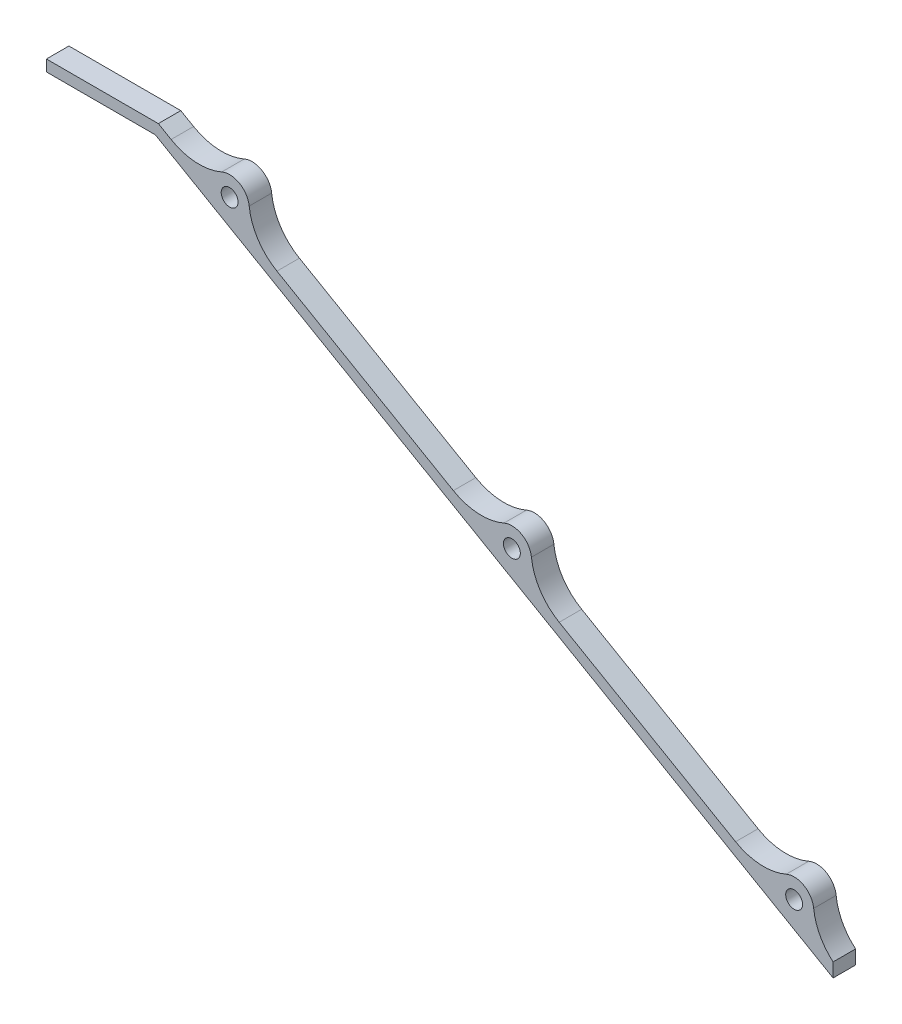
ISO-10303-21;
HEADER;
FILE_DESCRIPTION(('STEP AP214'),'2;1');
FILE_NAME('part.step','',(''),(''),'','','');
FILE_SCHEMA(('AUTOMOTIVE_DESIGN { 1 0 10303 214 1 1 1 1 }'));
ENDSEC;
DATA;
#1=APPLICATION_CONTEXT('core data for automotive mechanical design processes');
#2=APPLICATION_PROTOCOL_DEFINITION('international standard','automotive_design',2000,#1);
#3=PRODUCT_CONTEXT('',#1,'mechanical');
#4=PRODUCT('Part','Part','',(#3));
#5=PRODUCT_RELATED_PRODUCT_CATEGORY('part','',(#4));
#6=PRODUCT_DEFINITION_FORMATION('','',#4);
#7=PRODUCT_DEFINITION_CONTEXT('part definition',#1,'design');
#8=PRODUCT_DEFINITION('design','',#6,#7);
#9=PRODUCT_DEFINITION_SHAPE('','',#8);
#10=(LENGTH_UNIT() NAMED_UNIT(*) SI_UNIT(.MILLI.,.METRE.));
#11=(NAMED_UNIT(*) PLANE_ANGLE_UNIT() SI_UNIT($,.RADIAN.));
#12=(NAMED_UNIT(*) SI_UNIT($,.STERADIAN.) SOLID_ANGLE_UNIT());
#13=UNCERTAINTY_MEASURE_WITH_UNIT(LENGTH_MEASURE(1.E-05),#10,'distance_accuracy_value','');
#14=(GEOMETRIC_REPRESENTATION_CONTEXT(3) GLOBAL_UNCERTAINTY_ASSIGNED_CONTEXT((#13)) GLOBAL_UNIT_ASSIGNED_CONTEXT((#10,
#11,#12)) REPRESENTATION_CONTEXT('',''));
#15=CARTESIAN_POINT('',(0.,0.,0.));
#16=DIRECTION('',(0.,0.,1.));
#17=DIRECTION('',(1.,0.,0.));
#18=AXIS2_PLACEMENT_3D('',#15,#16,#17);
#19=CARTESIAN_POINT('',(0.,0.,4.));
#20=DIRECTION('',(0.,0.,1.));
#21=DIRECTION('',(1.,0.,0.));
#22=AXIS2_PLACEMENT_3D('',#19,#20,#21);
#23=PLANE('',#22);
#24=CARTESIAN_POINT('',(-37.3945369289585,94.9820508075689,4.));
#25=DIRECTION('',(0.,0.,1.));
#26=DIRECTION('',(1.,0.,0.));
#27=AXIS2_PLACEMENT_3D('',#24,#25,#26);
#28=CIRCLE('',#27,1.5);
#29=CARTESIAN_POINT('',(-35.8945369289585,94.9820508075689,4.));
#30=VERTEX_POINT('',#29);
#31=EDGE_CURVE('E190',#30,#30,#28,.F.);
#32=ORIENTED_EDGE('',*,*,#31,.T.);
#33=EDGE_LOOP('',(#32));
#34=FACE_BOUND('',#33,.T.);
#35=CARTESIAN_POINT('',(12.8349364905389,65.9820508075689,4.));
#36=DIRECTION('',(0.,0.,1.));
#37=DIRECTION('',(1.,0.,0.));
#38=AXIS2_PLACEMENT_3D('',#35,#36,#37);
#39=CIRCLE('',#38,1.5);
#40=CARTESIAN_POINT('',(14.3349364905389,65.9820508075689,4.));
#41=VERTEX_POINT('',#40);
#42=EDGE_CURVE('E276',#41,#41,#39,.F.);
#43=ORIENTED_EDGE('',*,*,#42,.T.);
#44=EDGE_LOOP('',(#43));
#45=FACE_BOUND('',#44,.T.);
#46=CARTESIAN_POINT('',(63.0644099100364,36.9820508075689,4.));
#47=DIRECTION('',(0.,0.,1.));
#48=DIRECTION('',(1.,0.,0.));
#49=AXIS2_PLACEMENT_3D('',#46,#47,#48);
#50=CIRCLE('',#49,1.5);
#51=CARTESIAN_POINT('',(64.5644099100364,36.9820508075689,4.));
#52=VERTEX_POINT('',#51);
#53=EDGE_CURVE('E306',#52,#52,#50,.F.);
#54=ORIENTED_EDGE('',*,*,#53,.T.);
#55=EDGE_LOOP('',(#54));
#56=FACE_BOUND('',#55,.T.);
#57=DIRECTION('',(-0.866025403784439,0.5,0.));
#58=VECTOR('',#57,1.);
#59=CARTESIAN_POINT('',(-50.6217782649107,98.,4.));
#60=LINE('',#59,#58);
#61=CARTESIAN_POINT('',(70.,28.3589838486225,4.));
#62=VERTEX_POINT('',#61);
#63=CARTESIAN_POINT('',(-50.6217782649107,98.,4.));
#64=VERTEX_POINT('',#63);
#65=EDGE_CURVE('E167',#62,#64,#60,.T.);
#66=ORIENTED_EDGE('',*,*,#65,.F.);
#67=DIRECTION('',(0.,1.,0.));
#68=VECTOR('',#67,1.);
#69=CARTESIAN_POINT('',(70.,0.,4.));
#70=LINE('',#69,#68);
#71=CARTESIAN_POINT('',(70.,30.8402003626561,4.));
#72=VERTEX_POINT('',#71);
#73=EDGE_CURVE('E153',#62,#72,#70,.T.);
#74=ORIENTED_EDGE('',*,*,#73,.T.);
#75=CARTESIAN_POINT('',(76.4840133823089,38.4531873229786,4.));
#76=DIRECTION('',(0.,0.,1.));
#77=DIRECTION('',(1.,0.,0.));
#78=AXIS2_PLACEMENT_3D('',#75,#76,#77);
#79=CIRCLE('',#78,10.);
#80=CARTESIAN_POINT('',(66.5435663658107,37.3634565708233,4.));
#81=VERTEX_POINT('',#80);
#82=EDGE_CURVE('E242',#72,#81,#79,.F.);
#83=ORIENTED_EDGE('',*,*,#82,.T.);
#84=CARTESIAN_POINT('',(63.0644099100364,36.9820508075689,4.));
#85=DIRECTION('',(0.,0.,1.));
#86=DIRECTION('',(1.,0.,0.));
#87=AXIS2_PLACEMENT_3D('',#84,#85,#86);
#88=CIRCLE('',#87,3.5);
#89=CARTESIAN_POINT('',(61.6598977357241,40.18788073946,4.));
#90=VERTEX_POINT('',#89);
#91=EDGE_CURVE('E161',#90,#81,#88,.F.);
#92=ORIENTED_EDGE('',*,*,#91,.F.);
#93=CARTESIAN_POINT('',(57.6470058091177,49.3473948305773,4.));
#94=DIRECTION('',(0.,0.,1.));
#95=DIRECTION('',(1.,0.,0.));
#96=AXIS2_PLACEMENT_3D('',#93,#94,#95);
#97=CIRCLE('',#96,10.);
#98=CARTESIAN_POINT('',(52.6470058091176,40.6871407927329,4.));
#99=VERTEX_POINT('',#98);
#100=EDGE_CURVE('E237',#90,#99,#97,.F.);
#101=ORIENTED_EDGE('',*,*,#100,.T.);
#102=DIRECTION('',(-0.866025403784439,0.5,0.));
#103=VECTOR('',#102,1.);
#104=CARTESIAN_POINT('',(-49.6217782649107,99.7320508075689,4.));
#105=LINE('',#104,#103);
#106=CARTESIAN_POINT('',(21.2523405914576,58.8128592072671,4.));
#107=VERTEX_POINT('',#106);
#108=EDGE_CURVE('E181',#99,#107,#105,.T.);
#109=ORIENTED_EDGE('',*,*,#108,.T.);
#110=CARTESIAN_POINT('',(26.2523405914576,67.4731132451115,4.));
#111=DIRECTION('',(0.,0.,1.));
#112=DIRECTION('',(1.,0.,0.));
#113=AXIS2_PLACEMENT_3D('',#110,#111,#112);
#114=CIRCLE('',#113,10.);
#115=CARTESIAN_POINT('',(16.3135227389252,66.3686225506355,4.));
#116=VERTEX_POINT('',#115);
#117=EDGE_CURVE('E246',#107,#116,#114,.F.);
#118=ORIENTED_EDGE('',*,*,#117,.T.);
#119=CARTESIAN_POINT('',(12.8349364905389,65.9820508075689,4.));
#120=DIRECTION('',(0.,0.,1.));
#121=DIRECTION('',(1.,0.,0.));
#122=AXIS2_PLACEMENT_3D('',#119,#120,#121);
#123=CIRCLE('',#122,3.5);
#124=CARTESIAN_POINT('',(11.4304243162267,69.18788073946,4.));
#125=VERTEX_POINT('',#124);
#126=EDGE_CURVE('E309',#125,#116,#123,.F.);
#127=ORIENTED_EDGE('',*,*,#126,.F.);
#128=CARTESIAN_POINT('',(7.41753238962021,78.3473948305773,4.));
#129=DIRECTION('',(0.,0.,1.));
#130=DIRECTION('',(1.,0.,0.));
#131=AXIS2_PLACEMENT_3D('',#128,#129,#130);
#132=CIRCLE('',#131,10.);
#133=CARTESIAN_POINT('',(2.41753238962019,69.6871407927329,4.));
#134=VERTEX_POINT('',#133);
#135=EDGE_CURVE('E250',#125,#134,#132,.F.);
#136=ORIENTED_EDGE('',*,*,#135,.T.);
#137=CARTESIAN_POINT('',(-28.9771328280398,87.8128592072671,4.));
#138=VERTEX_POINT('',#137);
#139=EDGE_CURVE('E179',#134,#138,#105,.T.);
#140=ORIENTED_EDGE('',*,*,#139,.T.);
#141=CARTESIAN_POINT('',(-23.9771328280398,96.4731132451115,4.));
#142=DIRECTION('',(0.,0.,1.));
#143=DIRECTION('',(1.,0.,0.));
#144=AXIS2_PLACEMENT_3D('',#141,#142,#143);
#145=CIRCLE('',#144,10.);
#146=CARTESIAN_POINT('',(-33.9159506805722,95.3686225506355,4.));
#147=VERTEX_POINT('',#146);
#148=EDGE_CURVE('E12',#138,#147,#145,.F.);
#149=ORIENTED_EDGE('',*,*,#148,.T.);
#150=CARTESIAN_POINT('',(-37.3945369289585,94.9820508075689,4.));
#151=DIRECTION('',(0.,0.,1.));
#152=DIRECTION('',(1.,0.,0.));
#153=AXIS2_PLACEMENT_3D('',#150,#151,#152);
#154=CIRCLE('',#153,3.5);
#155=CARTESIAN_POINT('',(-38.7990491032708,98.18788073946,4.));
#156=VERTEX_POINT('',#155);
#157=EDGE_CURVE('E270',#156,#147,#154,.F.);
#158=ORIENTED_EDGE('',*,*,#157,.F.);
#159=CARTESIAN_POINT('',(-42.8119410298772,107.347394830577,4.));
#160=DIRECTION('',(0.,0.,1.));
#161=DIRECTION('',(1.,0.,0.));
#162=AXIS2_PLACEMENT_3D('',#159,#160,#161);
#163=CIRCLE('',#162,10.);
#164=CARTESIAN_POINT('',(-47.8119410298772,98.6871407927329,4.));
#165=VERTEX_POINT('',#164);
#166=EDGE_CURVE('E254',#156,#165,#163,.F.);
#167=ORIENTED_EDGE('',*,*,#166,.T.);
#168=CARTESIAN_POINT('',(-50.0858798800485,100.,4.));
#169=VERTEX_POINT('',#168);
#170=EDGE_CURVE('E177',#165,#169,#105,.T.);
#171=ORIENTED_EDGE('',*,*,#170,.T.);
#172=DIRECTION('',(1.,0.,0.));
#173=VECTOR('',#172,1.);
#174=CARTESIAN_POINT('',(-50.6217782649107,100.,4.));
#175=LINE('',#174,#173);
#176=CARTESIAN_POINT('',(-70.,100.,4.));
#177=VERTEX_POINT('',#176);
#178=EDGE_CURVE('E289',#169,#177,#175,.F.);
#179=ORIENTED_EDGE('',*,*,#178,.T.);
#180=DIRECTION('',(0.,1.,0.));
#181=VECTOR('',#180,1.);
#182=CARTESIAN_POINT('',(-70.,98.,4.));
#183=LINE('',#182,#181);
#184=CARTESIAN_POINT('',(-70.,98.,4.));
#185=VERTEX_POINT('',#184);
#186=EDGE_CURVE('E182',#185,#177,#183,.T.);
#187=ORIENTED_EDGE('',*,*,#186,.F.);
#188=DIRECTION('',(-1.,0.,0.));
#189=VECTOR('',#188,1.);
#190=CARTESIAN_POINT('',(-50.6217782649107,98.,4.));
#191=LINE('',#190,#189);
#192=EDGE_CURVE('E176',#64,#185,#191,.T.);
#193=ORIENTED_EDGE('',*,*,#192,.F.);
#194=EDGE_LOOP('',(#66,#74,#83,#92,#101,#109,#118,#127,#136,#140,#149,#158,#167,#171,#179,#187,#193));
#195=FACE_BOUND('',#194,.T.);
#196=ADVANCED_FACE('F37',(#34,#45,#56,#195),#23,.T.);
#197=CARTESIAN_POINT('',(0.,0.,0.));
#198=DIRECTION('',(0.,0.,1.));
#199=DIRECTION('',(1.,0.,0.));
#200=AXIS2_PLACEMENT_3D('',#197,#198,#199);
#201=PLANE('',#200);
#202=CARTESIAN_POINT('',(63.0644099100364,36.9820508075689,0.));
#203=DIRECTION('',(0.,0.,-1.));
#204=DIRECTION('',(-1.,0.,0.));
#205=AXIS2_PLACEMENT_3D('',#202,#203,#204);
#206=CIRCLE('',#205,1.5);
#207=CARTESIAN_POINT('',(61.5644099100364,36.9820508075689,0.));
#208=VERTEX_POINT('',#207);
#209=EDGE_CURVE('E305',#208,#208,#206,.T.);
#210=ORIENTED_EDGE('',*,*,#209,.F.);
#211=EDGE_LOOP('',(#210));
#212=FACE_BOUND('',#211,.T.);
#213=CARTESIAN_POINT('',(12.8349364905389,65.9820508075689,0.));
#214=DIRECTION('',(0.,0.,-1.));
#215=DIRECTION('',(-1.,0.,0.));
#216=AXIS2_PLACEMENT_3D('',#213,#214,#215);
#217=CIRCLE('',#216,1.5);
#218=CARTESIAN_POINT('',(11.3349364905389,65.9820508075689,0.));
#219=VERTEX_POINT('',#218);
#220=EDGE_CURVE('E315',#219,#219,#217,.T.);
#221=ORIENTED_EDGE('',*,*,#220,.F.);
#222=EDGE_LOOP('',(#221));
#223=FACE_BOUND('',#222,.T.);
#224=CARTESIAN_POINT('',(-37.3945369289585,94.9820508075689,0.));
#225=DIRECTION('',(0.,0.,-1.));
#226=DIRECTION('',(-1.,0.,0.));
#227=AXIS2_PLACEMENT_3D('',#224,#225,#226);
#228=CIRCLE('',#227,1.5);
#229=CARTESIAN_POINT('',(-38.8945369289585,94.9820508075689,0.));
#230=VERTEX_POINT('',#229);
#231=EDGE_CURVE('E275',#230,#230,#228,.T.);
#232=ORIENTED_EDGE('',*,*,#231,.F.);
#233=EDGE_LOOP('',(#232));
#234=FACE_BOUND('',#233,.T.);
#235=DIRECTION('',(0.,-1.,0.));
#236=VECTOR('',#235,1.);
#237=CARTESIAN_POINT('',(70.,0.,0.));
#238=LINE('',#237,#236);
#239=CARTESIAN_POINT('',(70.,30.8402003626561,0.));
#240=VERTEX_POINT('',#239);
#241=CARTESIAN_POINT('',(70.,28.3589838486225,0.));
#242=VERTEX_POINT('',#241);
#243=EDGE_CURVE('E52',#240,#242,#238,.T.);
#244=ORIENTED_EDGE('',*,*,#243,.T.);
#245=DIRECTION('',(-0.866025403784439,0.5,0.));
#246=VECTOR('',#245,1.);
#247=CARTESIAN_POINT('',(-50.6217782649107,98.,0.));
#248=LINE('',#247,#246);
#249=CARTESIAN_POINT('',(-50.6217782649107,98.,0.));
#250=VERTEX_POINT('',#249);
#251=EDGE_CURVE('E169',#242,#250,#248,.T.);
#252=ORIENTED_EDGE('',*,*,#251,.T.);
#253=DIRECTION('',(-1.,0.,0.));
#254=VECTOR('',#253,1.);
#255=CARTESIAN_POINT('',(-50.6217782649107,98.,0.));
#256=LINE('',#255,#254);
#257=CARTESIAN_POINT('',(-70.,98.,0.));
#258=VERTEX_POINT('',#257);
#259=EDGE_CURVE('E193',#250,#258,#256,.T.);
#260=ORIENTED_EDGE('',*,*,#259,.T.);
#261=DIRECTION('',(0.,1.,0.));
#262=VECTOR('',#261,1.);
#263=CARTESIAN_POINT('',(-70.,98.,0.));
#264=LINE('',#263,#262);
#265=CARTESIAN_POINT('',(-70.,100.,0.));
#266=VERTEX_POINT('',#265);
#267=EDGE_CURVE('E189',#258,#266,#264,.T.);
#268=ORIENTED_EDGE('',*,*,#267,.T.);
#269=DIRECTION('',(1.,0.,0.));
#270=VECTOR('',#269,1.);
#271=CARTESIAN_POINT('',(-50.6217782649107,100.,0.));
#272=LINE('',#271,#270);
#273=CARTESIAN_POINT('',(-50.0858798800485,100.,0.));
#274=VERTEX_POINT('',#273);
#275=EDGE_CURVE('E186',#274,#266,#272,.F.);
#276=ORIENTED_EDGE('',*,*,#275,.F.);
#277=DIRECTION('',(-0.866025403784439,0.5,0.));
#278=VECTOR('',#277,1.);
#279=CARTESIAN_POINT('',(-49.6217782649107,99.7320508075689,0.));
#280=LINE('',#279,#278);
#281=CARTESIAN_POINT('',(-47.8119410298772,98.6871407927329,0.));
#282=VERTEX_POINT('',#281);
#283=EDGE_CURVE('E197',#282,#274,#280,.T.);
#284=ORIENTED_EDGE('',*,*,#283,.F.);
#285=CARTESIAN_POINT('',(-42.8119410298772,107.347394830577,0.));
#286=DIRECTION('',(0.,0.,1.));
#287=DIRECTION('',(1.,0.,0.));
#288=AXIS2_PLACEMENT_3D('',#285,#286,#287);
#289=CIRCLE('',#288,10.);
#290=CARTESIAN_POINT('',(-38.7990491032708,98.18788073946,0.));
#291=VERTEX_POINT('',#290);
#292=EDGE_CURVE('E252',#282,#291,#289,.T.);
#293=ORIENTED_EDGE('',*,*,#292,.T.);
#294=CARTESIAN_POINT('',(-37.3945369289585,94.9820508075689,0.));
#295=DIRECTION('',(0.,0.,-1.));
#296=DIRECTION('',(-1.,0.,0.));
#297=AXIS2_PLACEMENT_3D('',#294,#295,#296);
#298=CIRCLE('',#297,3.5);
#299=CARTESIAN_POINT('',(-33.9159506805722,95.3686225506355,0.));
#300=VERTEX_POINT('',#299);
#301=EDGE_CURVE('E261',#291,#300,#298,.T.);
#302=ORIENTED_EDGE('',*,*,#301,.T.);
#303=CARTESIAN_POINT('',(-23.9771328280398,96.4731132451115,0.));
#304=DIRECTION('',(0.,0.,1.));
#305=DIRECTION('',(1.,0.,0.));
#306=AXIS2_PLACEMENT_3D('',#303,#304,#305);
#307=CIRCLE('',#306,10.);
#308=CARTESIAN_POINT('',(-28.9771328280398,87.8128592072671,0.));
#309=VERTEX_POINT('',#308);
#310=EDGE_CURVE('E45',#300,#309,#307,.T.);
#311=ORIENTED_EDGE('',*,*,#310,.T.);
#312=CARTESIAN_POINT('',(2.41753238962019,69.6871407927329,0.));
#313=VERTEX_POINT('',#312);
#314=EDGE_CURVE('E199',#313,#309,#280,.T.);
#315=ORIENTED_EDGE('',*,*,#314,.F.);
#316=CARTESIAN_POINT('',(7.41753238962021,78.3473948305773,0.));
#317=DIRECTION('',(0.,0.,1.));
#318=DIRECTION('',(1.,0.,0.));
#319=AXIS2_PLACEMENT_3D('',#316,#317,#318);
#320=CIRCLE('',#319,10.);
#321=CARTESIAN_POINT('',(11.4304243162267,69.18788073946,0.));
#322=VERTEX_POINT('',#321);
#323=EDGE_CURVE('E248',#313,#322,#320,.T.);
#324=ORIENTED_EDGE('',*,*,#323,.T.);
#325=CARTESIAN_POINT('',(12.8349364905389,65.9820508075689,0.));
#326=DIRECTION('',(0.,0.,-1.));
#327=DIRECTION('',(-1.,0.,0.));
#328=AXIS2_PLACEMENT_3D('',#325,#326,#327);
#329=CIRCLE('',#328,3.5);
#330=CARTESIAN_POINT('',(16.3135227389252,66.3686225506355,0.));
#331=VERTEX_POINT('',#330);
#332=EDGE_CURVE('E281',#322,#331,#329,.T.);
#333=ORIENTED_EDGE('',*,*,#332,.T.);
#334=CARTESIAN_POINT('',(26.2523405914576,67.4731132451115,0.));
#335=DIRECTION('',(0.,0.,1.));
#336=DIRECTION('',(1.,0.,0.));
#337=AXIS2_PLACEMENT_3D('',#334,#335,#336);
#338=CIRCLE('',#337,10.);
#339=CARTESIAN_POINT('',(21.2523405914576,58.8128592072671,0.));
#340=VERTEX_POINT('',#339);
#341=EDGE_CURVE('E244',#331,#340,#338,.T.);
#342=ORIENTED_EDGE('',*,*,#341,.T.);
#343=CARTESIAN_POINT('',(52.6470058091176,40.6871407927329,0.));
#344=VERTEX_POINT('',#343);
#345=EDGE_CURVE('E200',#344,#340,#280,.T.);
#346=ORIENTED_EDGE('',*,*,#345,.F.);
#347=CARTESIAN_POINT('',(57.6470058091177,49.3473948305773,0.));
#348=DIRECTION('',(0.,0.,1.));
#349=DIRECTION('',(1.,0.,0.));
#350=AXIS2_PLACEMENT_3D('',#347,#348,#349);
#351=CIRCLE('',#350,10.);
#352=CARTESIAN_POINT('',(61.6598977357241,40.18788073946,0.));
#353=VERTEX_POINT('',#352);
#354=EDGE_CURVE('E235',#344,#353,#351,.T.);
#355=ORIENTED_EDGE('',*,*,#354,.T.);
#356=CARTESIAN_POINT('',(63.0644099100364,36.9820508075689,0.));
#357=DIRECTION('',(0.,0.,-1.));
#358=DIRECTION('',(-1.,0.,0.));
#359=AXIS2_PLACEMENT_3D('',#356,#357,#358);
#360=CIRCLE('',#359,3.5);
#361=CARTESIAN_POINT('',(66.5435663658107,37.3634565708233,0.));
#362=VERTEX_POINT('',#361);
#363=EDGE_CURVE('E310',#353,#362,#360,.T.);
#364=ORIENTED_EDGE('',*,*,#363,.T.);
#365=CARTESIAN_POINT('',(76.4840133823089,38.4531873229786,0.));
#366=DIRECTION('',(0.,0.,1.));
#367=DIRECTION('',(1.,0.,0.));
#368=AXIS2_PLACEMENT_3D('',#365,#366,#367);
#369=CIRCLE('',#368,10.);
#370=EDGE_CURVE('E239',#362,#240,#369,.T.);
#371=ORIENTED_EDGE('',*,*,#370,.T.);
#372=EDGE_LOOP('',(#244,#252,#260,#268,#276,#284,#293,#302,#311,#315,#324,#333,#342,#346,#355,
#364,#371));
#373=FACE_BOUND('',#372,.T.);
#374=ADVANCED_FACE('F259',(#212,#223,#234,#373),#201,.F.);
#375=CARTESIAN_POINT('',(76.4840133823089,38.4531873229786,4.));
#376=DIRECTION('',(0.,0.,1.));
#377=DIRECTION('',(1.,0.,0.));
#378=AXIS2_PLACEMENT_3D('',#375,#376,#377);
#379=CYLINDRICAL_SURFACE('',#378,10.);
#380=DIRECTION('',(0.,0.,1.));
#381=VECTOR('',#380,1.);
#382=CARTESIAN_POINT('',(70.,30.8402003626561,4.));
#383=LINE('',#382,#381);
#384=EDGE_CURVE('E157',#72,#240,#383,.F.);
#385=ORIENTED_EDGE('',*,*,#384,.T.);
#386=ORIENTED_EDGE('',*,*,#370,.F.);
#387=DIRECTION('',(0.,0.,-1.));
#388=VECTOR('',#387,1.);
#389=CARTESIAN_POINT('',(66.5435663658107,37.3634565708233,14.2696803114159));
#390=LINE('',#389,#388);
#391=EDGE_CURVE('E213',#81,#362,#390,.T.);
#392=ORIENTED_EDGE('',*,*,#391,.F.);
#393=ORIENTED_EDGE('',*,*,#82,.F.);
#394=EDGE_LOOP('',(#385,#386,#392,#393));
#395=FACE_BOUND('',#394,.T.);
#396=ADVANCED_FACE('F366',(#395),#379,.F.);
#397=CARTESIAN_POINT('',(-49.6217782649107,99.7320508075689,4.));
#398=DIRECTION('',(-0.5,-0.866025403784439,0.));
#399=DIRECTION('',(0.866025403784439,-0.5,0.));
#400=AXIS2_PLACEMENT_3D('',#397,#398,#399);
#401=PLANE('',#400);
#402=ORIENTED_EDGE('',*,*,#108,.F.);
#403=DIRECTION('',(0.,0.,-1.));
#404=VECTOR('',#403,1.);
#405=CARTESIAN_POINT('',(52.6470058091177,40.6871407927329,4.));
#406=LINE('',#405,#404);
#407=EDGE_CURVE('E210',#99,#344,#406,.T.);
#408=ORIENTED_EDGE('',*,*,#407,.T.);
#409=ORIENTED_EDGE('',*,*,#345,.T.);
#410=DIRECTION('',(0.,0.,-1.));
#411=VECTOR('',#410,1.);
#412=CARTESIAN_POINT('',(21.2523405914576,58.8128592072671,4.));
#413=LINE('',#412,#411);
#414=EDGE_CURVE('E208',#340,#107,#413,.F.);
#415=ORIENTED_EDGE('',*,*,#414,.T.);
#416=EDGE_LOOP('',(#402,#408,#409,#415));
#417=FACE_BOUND('',#416,.T.);
#418=ADVANCED_FACE('F341',(#417),#401,.F.);
#419=ORIENTED_EDGE('',*,*,#139,.F.);
#420=DIRECTION('',(0.,0.,-1.));
#421=VECTOR('',#420,1.);
#422=CARTESIAN_POINT('',(2.41753238962021,69.6871407927329,4.));
#423=LINE('',#422,#421);
#424=EDGE_CURVE('E225',#134,#313,#423,.T.);
#425=ORIENTED_EDGE('',*,*,#424,.T.);
#426=ORIENTED_EDGE('',*,*,#314,.T.);
#427=DIRECTION('',(0.,0.,-1.));
#428=VECTOR('',#427,1.);
#429=CARTESIAN_POINT('',(-28.9771328280398,87.8128592072671,4.));
#430=LINE('',#429,#428);
#431=EDGE_CURVE('E223',#309,#138,#430,.F.);
#432=ORIENTED_EDGE('',*,*,#431,.T.);
#433=EDGE_LOOP('',(#419,#425,#426,#432));
#434=FACE_BOUND('',#433,.T.);
#435=ADVANCED_FACE('F264',(#434),#401,.F.);
#436=ORIENTED_EDGE('',*,*,#170,.F.);
#437=DIRECTION('',(0.,0.,-1.));
#438=VECTOR('',#437,1.);
#439=CARTESIAN_POINT('',(-47.8119410298772,98.6871407927329,4.));
#440=LINE('',#439,#438);
#441=EDGE_CURVE('E228',#165,#282,#440,.T.);
#442=ORIENTED_EDGE('',*,*,#441,.T.);
#443=ORIENTED_EDGE('',*,*,#283,.T.);
#444=DIRECTION('',(0.,0.,-1.));
#445=VECTOR('',#444,1.);
#446=CARTESIAN_POINT('',(-50.0858798800485,100.,4.));
#447=LINE('',#446,#445);
#448=EDGE_CURVE('E171',#169,#274,#447,.T.);
#449=ORIENTED_EDGE('',*,*,#448,.F.);
#450=EDGE_LOOP('',(#436,#442,#443,#449));
#451=FACE_BOUND('',#450,.T.);
#452=ADVANCED_FACE('F376',(#451),#401,.F.);
#453=CARTESIAN_POINT('',(-50.6217782649107,100.,4.));
#454=DIRECTION('',(0.,-1.,0.));
#455=DIRECTION('',(0.,0.,-1.));
#456=AXIS2_PLACEMENT_3D('',#453,#454,#455);
#457=PLANE('',#456);
#458=ORIENTED_EDGE('',*,*,#275,.T.);
#459=DIRECTION('',(0.,0.,-1.));
#460=VECTOR('',#459,1.);
#461=CARTESIAN_POINT('',(-70.,100.,4.));
#462=LINE('',#461,#460);
#463=EDGE_CURVE('E206',#177,#266,#462,.T.);
#464=ORIENTED_EDGE('',*,*,#463,.F.);
#465=ORIENTED_EDGE('',*,*,#178,.F.);
#466=ORIENTED_EDGE('',*,*,#448,.T.);
#467=EDGE_LOOP('',(#458,#464,#465,#466));
#468=FACE_BOUND('',#467,.T.);
#469=ADVANCED_FACE('F382',(#468),#457,.F.);
#470=CARTESIAN_POINT('',(-70.,98.,4.));
#471=DIRECTION('',(-1.,0.,0.));
#472=DIRECTION('',(0.,0.,1.));
#473=AXIS2_PLACEMENT_3D('',#470,#471,#472);
#474=PLANE('',#473);
#475=ORIENTED_EDGE('',*,*,#267,.F.);
#476=DIRECTION('',(0.,0.,-1.));
#477=VECTOR('',#476,1.);
#478=CARTESIAN_POINT('',(-70.,98.,4.));
#479=LINE('',#478,#477);
#480=EDGE_CURVE('E204',#185,#258,#479,.T.);
#481=ORIENTED_EDGE('',*,*,#480,.F.);
#482=ORIENTED_EDGE('',*,*,#186,.T.);
#483=ORIENTED_EDGE('',*,*,#463,.T.);
#484=EDGE_LOOP('',(#475,#481,#482,#483));
#485=FACE_BOUND('',#484,.T.);
#486=ADVANCED_FACE('F293',(#485),#474,.T.);
#487=CARTESIAN_POINT('',(-50.6217782649107,98.,4.));
#488=DIRECTION('',(0.,-1.,0.));
#489=DIRECTION('',(0.,0.,-1.));
#490=AXIS2_PLACEMENT_3D('',#487,#488,#489);
#491=PLANE('',#490);
#492=ORIENTED_EDGE('',*,*,#259,.F.);
#493=DIRECTION('',(0.,0.,-1.));
#494=VECTOR('',#493,1.);
#495=CARTESIAN_POINT('',(-50.6217782649107,98.,4.));
#496=LINE('',#495,#494);
#497=EDGE_CURVE('E170',#64,#250,#496,.T.);
#498=ORIENTED_EDGE('',*,*,#497,.F.);
#499=ORIENTED_EDGE('',*,*,#192,.T.);
#500=ORIENTED_EDGE('',*,*,#480,.T.);
#501=EDGE_LOOP('',(#492,#498,#499,#500));
#502=FACE_BOUND('',#501,.T.);
#503=ADVANCED_FACE('F298',(#502),#491,.T.);
#504=CARTESIAN_POINT('',(-50.6217782649107,98.,4.));
#505=DIRECTION('',(-0.5,-0.866025403784439,0.));
#506=DIRECTION('',(0.866025403784439,-0.5,0.));
#507=AXIS2_PLACEMENT_3D('',#504,#505,#506);
#508=PLANE('',#507);
#509=ORIENTED_EDGE('',*,*,#251,.F.);
#510=DIRECTION('',(0.,0.,-1.));
#511=VECTOR('',#510,1.);
#512=CARTESIAN_POINT('',(70.,28.3589838486225,4.));
#513=LINE('',#512,#511);
#514=EDGE_CURVE('E156',#62,#242,#513,.T.);
#515=ORIENTED_EDGE('',*,*,#514,.F.);
#516=ORIENTED_EDGE('',*,*,#65,.T.);
#517=ORIENTED_EDGE('',*,*,#497,.T.);
#518=EDGE_LOOP('',(#509,#515,#516,#517));
#519=FACE_BOUND('',#518,.T.);
#520=ADVANCED_FACE('F166',(#519),#508,.T.);
#521=CARTESIAN_POINT('',(-37.3945369289585,94.9820508075689,14.2696803114159));
#522=DIRECTION('',(0.,0.,-1.));
#523=DIRECTION('',(-1.,0.,0.));
#524=AXIS2_PLACEMENT_3D('',#521,#522,#523);
#525=CYLINDRICAL_SURFACE('',#524,1.5);
#526=ORIENTED_EDGE('',*,*,#231,.T.);
#527=EDGE_LOOP('',(#526));
#528=FACE_BOUND('',#527,.T.);
#529=ORIENTED_EDGE('',*,*,#31,.F.);
#530=EDGE_LOOP('',(#529));
#531=FACE_BOUND('',#530,.T.);
#532=ADVANCED_FACE('F371',(#528,#531),#525,.F.);
#533=CARTESIAN_POINT('',(-37.3945369289585,94.9820508075689,14.2696803114159));
#534=DIRECTION('',(0.,0.,-1.));
#535=DIRECTION('',(-1.,0.,0.));
#536=AXIS2_PLACEMENT_3D('',#533,#534,#535);
#537=CYLINDRICAL_SURFACE('',#536,3.5);
#538=ORIENTED_EDGE('',*,*,#301,.F.);
#539=DIRECTION('',(0.,0.,-1.));
#540=VECTOR('',#539,1.);
#541=CARTESIAN_POINT('',(-38.7990491032708,98.18788073946,14.2696803114159));
#542=LINE('',#541,#540);
#543=EDGE_CURVE('E233',#291,#156,#542,.F.);
#544=ORIENTED_EDGE('',*,*,#543,.T.);
#545=ORIENTED_EDGE('',*,*,#157,.T.);
#546=DIRECTION('',(0.,0.,-1.));
#547=VECTOR('',#546,1.);
#548=CARTESIAN_POINT('',(-33.9159506805722,95.3686225506355,14.2696803114159));
#549=LINE('',#548,#547);
#550=EDGE_CURVE('E231',#147,#300,#549,.T.);
#551=ORIENTED_EDGE('',*,*,#550,.T.);
#552=EDGE_LOOP('',(#538,#544,#545,#551));
#553=FACE_BOUND('',#552,.T.);
#554=ADVANCED_FACE('F273',(#553),#537,.T.);
#555=CARTESIAN_POINT('',(12.8349364905389,65.9820508075689,14.2696803114159));
#556=DIRECTION('',(0.,0.,-1.));
#557=DIRECTION('',(-1.,0.,0.));
#558=AXIS2_PLACEMENT_3D('',#555,#556,#557);
#559=CYLINDRICAL_SURFACE('',#558,1.5);
#560=ORIENTED_EDGE('',*,*,#220,.T.);
#561=EDGE_LOOP('',(#560));
#562=FACE_BOUND('',#561,.T.);
#563=ORIENTED_EDGE('',*,*,#42,.F.);
#564=EDGE_LOOP('',(#563));
#565=FACE_BOUND('',#564,.T.);
#566=ADVANCED_FACE('F433',(#562,#565),#559,.F.);
#567=CARTESIAN_POINT('',(12.8349364905389,65.9820508075689,14.2696803114159));
#568=DIRECTION('',(0.,0.,-1.));
#569=DIRECTION('',(-1.,0.,0.));
#570=AXIS2_PLACEMENT_3D('',#567,#568,#569);
#571=CYLINDRICAL_SURFACE('',#570,3.5);
#572=ORIENTED_EDGE('',*,*,#126,.T.);
#573=DIRECTION('',(0.,0.,-1.));
#574=VECTOR('',#573,1.);
#575=CARTESIAN_POINT('',(16.3135227389252,66.3686225506355,14.2696803114159));
#576=LINE('',#575,#574);
#577=EDGE_CURVE('E220',#116,#331,#576,.T.);
#578=ORIENTED_EDGE('',*,*,#577,.T.);
#579=ORIENTED_EDGE('',*,*,#332,.F.);
#580=DIRECTION('',(0.,0.,-1.));
#581=VECTOR('',#580,1.);
#582=CARTESIAN_POINT('',(11.4304243162267,69.18788073946,14.2696803114159));
#583=LINE('',#582,#581);
#584=EDGE_CURVE('E218',#322,#125,#583,.F.);
#585=ORIENTED_EDGE('',*,*,#584,.T.);
#586=EDGE_LOOP('',(#572,#578,#579,#585));
#587=FACE_BOUND('',#586,.T.);
#588=ADVANCED_FACE('F325',(#587),#571,.T.);
#589=CARTESIAN_POINT('',(63.0644099100364,36.9820508075689,14.2696803114159));
#590=DIRECTION('',(0.,0.,-1.));
#591=DIRECTION('',(-1.,0.,0.));
#592=AXIS2_PLACEMENT_3D('',#589,#590,#591);
#593=CYLINDRICAL_SURFACE('',#592,1.5);
#594=ORIENTED_EDGE('',*,*,#209,.T.);
#595=EDGE_LOOP('',(#594));
#596=FACE_BOUND('',#595,.T.);
#597=ORIENTED_EDGE('',*,*,#53,.F.);
#598=EDGE_LOOP('',(#597));
#599=FACE_BOUND('',#598,.T.);
#600=ADVANCED_FACE('F356',(#596,#599),#593,.F.);
#601=CARTESIAN_POINT('',(63.0644099100364,36.9820508075689,14.2696803114159));
#602=DIRECTION('',(0.,0.,-1.));
#603=DIRECTION('',(-1.,0.,0.));
#604=AXIS2_PLACEMENT_3D('',#601,#602,#603);
#605=CYLINDRICAL_SURFACE('',#604,3.5);
#606=ORIENTED_EDGE('',*,*,#363,.F.);
#607=DIRECTION('',(0.,0.,-1.));
#608=VECTOR('',#607,1.);
#609=CARTESIAN_POINT('',(61.6598977357241,40.18788073946,14.2696803114159));
#610=LINE('',#609,#608);
#611=EDGE_CURVE('E216',#353,#90,#610,.F.);
#612=ORIENTED_EDGE('',*,*,#611,.T.);
#613=ORIENTED_EDGE('',*,*,#91,.T.);
#614=ORIENTED_EDGE('',*,*,#391,.T.);
#615=EDGE_LOOP('',(#606,#612,#613,#614));
#616=FACE_BOUND('',#615,.T.);
#617=ADVANCED_FACE('F346',(#616),#605,.T.);
#618=CARTESIAN_POINT('',(57.6470058091177,49.3473948305773,14.2696803114159));
#619=DIRECTION('',(0.,0.,-1.));
#620=DIRECTION('',(-1.,0.,0.));
#621=AXIS2_PLACEMENT_3D('',#618,#619,#620);
#622=CYLINDRICAL_SURFACE('',#621,10.);
#623=ORIENTED_EDGE('',*,*,#100,.F.);
#624=ORIENTED_EDGE('',*,*,#611,.F.);
#625=ORIENTED_EDGE('',*,*,#354,.F.);
#626=ORIENTED_EDGE('',*,*,#407,.F.);
#627=EDGE_LOOP('',(#623,#624,#625,#626));
#628=FACE_BOUND('',#627,.T.);
#629=ADVANCED_FACE('F348',(#628),#622,.F.);
#630=CARTESIAN_POINT('',(26.2523405914576,67.4731132451115,14.2696803114159));
#631=DIRECTION('',(0.,0.,-1.));
#632=DIRECTION('',(-1.,0.,0.));
#633=AXIS2_PLACEMENT_3D('',#630,#631,#632);
#634=CYLINDRICAL_SURFACE('',#633,10.);
#635=ORIENTED_EDGE('',*,*,#117,.F.);
#636=ORIENTED_EDGE('',*,*,#414,.F.);
#637=ORIENTED_EDGE('',*,*,#341,.F.);
#638=ORIENTED_EDGE('',*,*,#577,.F.);
#639=EDGE_LOOP('',(#635,#636,#637,#638));
#640=FACE_BOUND('',#639,.T.);
#641=ADVANCED_FACE('F340',(#640),#634,.F.);
#642=CARTESIAN_POINT('',(7.41753238962021,78.3473948305773,14.2696803114159));
#643=DIRECTION('',(0.,0.,-1.));
#644=DIRECTION('',(-1.,0.,0.));
#645=AXIS2_PLACEMENT_3D('',#642,#643,#644);
#646=CYLINDRICAL_SURFACE('',#645,10.);
#647=ORIENTED_EDGE('',*,*,#135,.F.);
#648=ORIENTED_EDGE('',*,*,#584,.F.);
#649=ORIENTED_EDGE('',*,*,#323,.F.);
#650=ORIENTED_EDGE('',*,*,#424,.F.);
#651=EDGE_LOOP('',(#647,#648,#649,#650));
#652=FACE_BOUND('',#651,.T.);
#653=ADVANCED_FACE('F330',(#652),#646,.F.);
#654=CARTESIAN_POINT('',(-42.8119410298772,107.347394830577,14.2696803114159));
#655=DIRECTION('',(0.,0.,-1.));
#656=DIRECTION('',(-1.,0.,0.));
#657=AXIS2_PLACEMENT_3D('',#654,#655,#656);
#658=CYLINDRICAL_SURFACE('',#657,10.);
#659=ORIENTED_EDGE('',*,*,#166,.F.);
#660=ORIENTED_EDGE('',*,*,#543,.F.);
#661=ORIENTED_EDGE('',*,*,#292,.F.);
#662=ORIENTED_EDGE('',*,*,#441,.F.);
#663=EDGE_LOOP('',(#659,#660,#661,#662));
#664=FACE_BOUND('',#663,.T.);
#665=ADVANCED_FACE('F395',(#664),#658,.F.);
#666=CARTESIAN_POINT('',(-23.9771328280398,96.4731132451115,14.2696803114159));
#667=DIRECTION('',(0.,0.,-1.));
#668=DIRECTION('',(-1.,0.,0.));
#669=AXIS2_PLACEMENT_3D('',#666,#667,#668);
#670=CYLINDRICAL_SURFACE('',#669,10.);
#671=ORIENTED_EDGE('',*,*,#148,.F.);
#672=ORIENTED_EDGE('',*,*,#431,.F.);
#673=ORIENTED_EDGE('',*,*,#310,.F.);
#674=ORIENTED_EDGE('',*,*,#550,.F.);
#675=EDGE_LOOP('',(#671,#672,#673,#674));
#676=FACE_BOUND('',#675,.T.);
#677=ADVANCED_FACE('F39',(#676),#670,.F.);
#678=CARTESIAN_POINT('',(70.,0.,-0.00100000000000013));
#679=DIRECTION('',(1.,0.,0.));
#680=DIRECTION('',(0.,0.,-1.));
#681=AXIS2_PLACEMENT_3D('',#678,#679,#680);
#682=PLANE('',#681);
#683=ORIENTED_EDGE('',*,*,#384,.F.);
#684=ORIENTED_EDGE('',*,*,#73,.F.);
#685=ORIENTED_EDGE('',*,*,#514,.T.);
#686=ORIENTED_EDGE('',*,*,#243,.F.);
#687=EDGE_LOOP('',(#683,#684,#685,#686));
#688=FACE_BOUND('',#687,.T.);
#689=ADVANCED_FACE('F155',(#688),#682,.T.);
#690=CLOSED_SHELL('',(#196,#374,#396,#418,#435,#452,#469,#486,#503,#520,#532,#554,#566,#588,
#600,#617,#629,#641,#653,#665,#677,#689));
#691=MANIFOLD_SOLID_BREP('B2',#690);
#692=ADVANCED_BREP_SHAPE_REPRESENTATION('',(#18,#691),#14);
#693=SHAPE_DEFINITION_REPRESENTATION(#9,#692);
ENDSEC;
END-ISO-10303-21;
